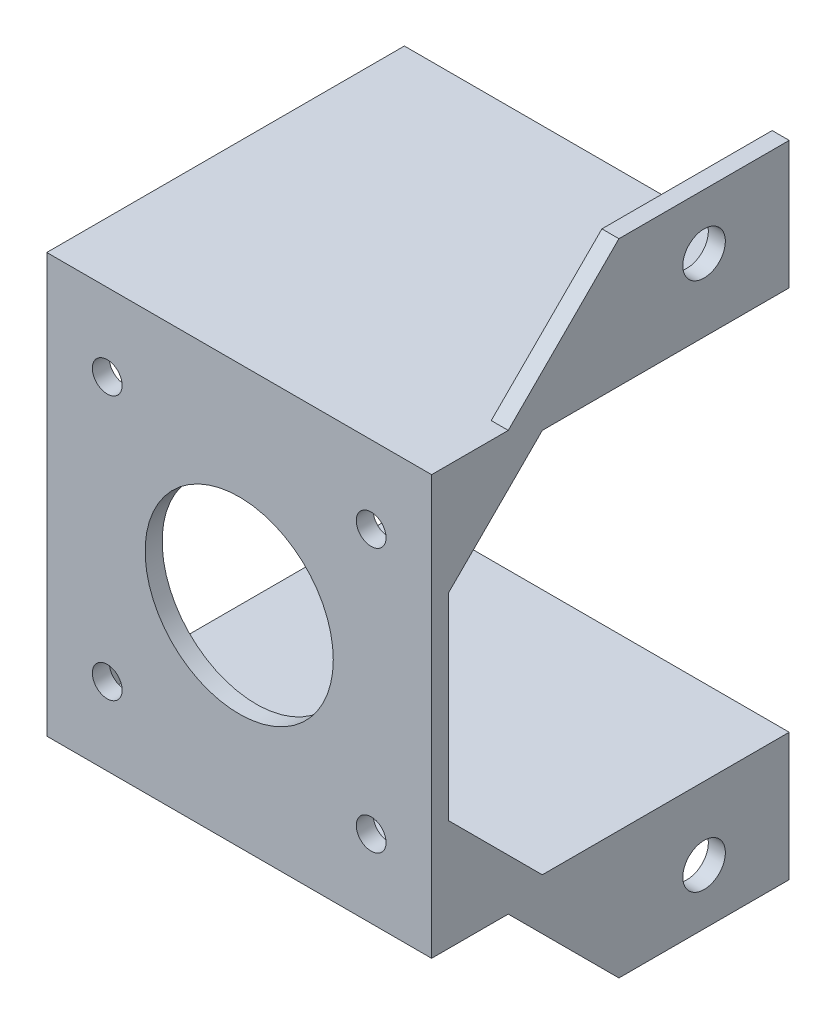
ISO-10303-21;
HEADER;
FILE_DESCRIPTION(('STEP AP214'),'2;1');
FILE_NAME('part.step','',(''),(''),'','','');
FILE_SCHEMA(('AUTOMOTIVE_DESIGN { 1 0 10303 214 1 1 1 1 }'));
ENDSEC;
DATA;
#1=APPLICATION_CONTEXT('core data for automotive mechanical design processes');
#2=APPLICATION_PROTOCOL_DEFINITION('international standard','automotive_design',2000,#1);
#3=PRODUCT_CONTEXT('',#1,'mechanical');
#4=PRODUCT('Part','Part','',(#3));
#5=PRODUCT_RELATED_PRODUCT_CATEGORY('part','',(#4));
#6=PRODUCT_DEFINITION_FORMATION('','',#4);
#7=PRODUCT_DEFINITION_CONTEXT('part definition',#1,'design');
#8=PRODUCT_DEFINITION('design','',#6,#7);
#9=PRODUCT_DEFINITION_SHAPE('','',#8);
#10=(LENGTH_UNIT() NAMED_UNIT(*) SI_UNIT(.MILLI.,.METRE.));
#11=(NAMED_UNIT(*) PLANE_ANGLE_UNIT() SI_UNIT($,.RADIAN.));
#12=(NAMED_UNIT(*) SI_UNIT($,.STERADIAN.) SOLID_ANGLE_UNIT());
#13=UNCERTAINTY_MEASURE_WITH_UNIT(LENGTH_MEASURE(1.E-05),#10,'distance_accuracy_value','');
#14=(GEOMETRIC_REPRESENTATION_CONTEXT(3) GLOBAL_UNCERTAINTY_ASSIGNED_CONTEXT((#13)) GLOBAL_UNIT_ASSIGNED_CONTEXT((#10,
#11,#12)) REPRESENTATION_CONTEXT('',''));
#15=CARTESIAN_POINT('',(0.,0.,0.));
#16=DIRECTION('',(0.,0.,1.));
#17=DIRECTION('',(1.,0.,0.));
#18=AXIS2_PLACEMENT_3D('',#15,#16,#17);
#19=CARTESIAN_POINT('',(0.,0.,2.));
#20=DIRECTION('',(0.,0.,-1.));
#21=DIRECTION('',(-1.,0.,0.));
#22=AXIS2_PLACEMENT_3D('',#19,#20,#21);
#23=PLANE('',#22);
#24=DIRECTION('',(0.,1.,0.));
#25=VECTOR('',#24,1.);
#26=CARTESIAN_POINT('',(22.6,-22.6,2.));
#27=LINE('',#26,#25);
#28=CARTESIAN_POINT('',(22.6,-24.6,2.));
#29=VERTEX_POINT('',#28);
#30=CARTESIAN_POINT('',(22.6,24.6,2.));
#31=VERTEX_POINT('',#30);
#32=EDGE_CURVE('E340',#29,#31,#27,.T.);
#33=ORIENTED_EDGE('',*,*,#32,.T.);
#34=DIRECTION('',(-1.,0.,0.));
#35=VECTOR('',#34,1.);
#36=CARTESIAN_POINT('',(22.6,24.6,2.));
#37=LINE('',#36,#35);
#38=CARTESIAN_POINT('',(-22.6,24.6,2.));
#39=VERTEX_POINT('',#38);
#40=EDGE_CURVE('E262',#31,#39,#37,.T.);
#41=ORIENTED_EDGE('',*,*,#40,.T.);
#42=DIRECTION('',(0.,-1.,0.));
#43=VECTOR('',#42,1.);
#44=CARTESIAN_POINT('',(-22.6,-22.6,2.));
#45=LINE('',#44,#43);
#46=CARTESIAN_POINT('',(-22.6,-24.6,2.));
#47=VERTEX_POINT('',#46);
#48=EDGE_CURVE('E343',#39,#47,#45,.T.);
#49=ORIENTED_EDGE('',*,*,#48,.T.);
#50=DIRECTION('',(-1.,0.,0.));
#51=VECTOR('',#50,1.);
#52=CARTESIAN_POINT('',(22.6,-24.6,2.));
#53=LINE('',#52,#51);
#54=EDGE_CURVE('E462',#29,#47,#53,.T.);
#55=ORIENTED_EDGE('',*,*,#54,.F.);
#56=EDGE_LOOP('',(#33,#41,#49,#55));
#57=FACE_BOUND('',#56,.T.);
#58=CARTESIAN_POINT('',(-15.5,15.5,2.));
#59=DIRECTION('',(0.,0.,1.));
#60=DIRECTION('',(1.,0.,0.));
#61=AXIS2_PLACEMENT_3D('',#58,#59,#60);
#62=CIRCLE('',#61,1.75);
#63=CARTESIAN_POINT('',(-13.75,15.5,2.));
#64=VERTEX_POINT('',#63);
#65=EDGE_CURVE('E333',#64,#64,#62,.T.);
#66=ORIENTED_EDGE('',*,*,#65,.F.);
#67=EDGE_LOOP('',(#66));
#68=FACE_BOUND('',#67,.T.);
#69=CARTESIAN_POINT('',(15.5,15.5,2.));
#70=DIRECTION('',(0.,0.,1.));
#71=DIRECTION('',(1.,0.,0.));
#72=AXIS2_PLACEMENT_3D('',#69,#70,#71);
#73=CIRCLE('',#72,1.75);
#74=CARTESIAN_POINT('',(17.25,15.5,2.));
#75=VERTEX_POINT('',#74);
#76=EDGE_CURVE('E325',#75,#75,#73,.T.);
#77=ORIENTED_EDGE('',*,*,#76,.F.);
#78=EDGE_LOOP('',(#77));
#79=FACE_BOUND('',#78,.T.);
#80=CARTESIAN_POINT('',(-15.5,-15.5,2.));
#81=DIRECTION('',(0.,0.,1.));
#82=DIRECTION('',(1.,0.,0.));
#83=AXIS2_PLACEMENT_3D('',#80,#81,#82);
#84=CIRCLE('',#83,1.75);
#85=CARTESIAN_POINT('',(-13.75,-15.5,2.));
#86=VERTEX_POINT('',#85);
#87=EDGE_CURVE('E317',#86,#86,#84,.T.);
#88=ORIENTED_EDGE('',*,*,#87,.F.);
#89=EDGE_LOOP('',(#88));
#90=FACE_BOUND('',#89,.T.);
#91=CARTESIAN_POINT('',(15.5,-15.5,2.));
#92=DIRECTION('',(0.,0.,1.));
#93=DIRECTION('',(1.,0.,0.));
#94=AXIS2_PLACEMENT_3D('',#91,#92,#93);
#95=CIRCLE('',#94,1.75);
#96=CARTESIAN_POINT('',(17.25,-15.5,2.));
#97=VERTEX_POINT('',#96);
#98=EDGE_CURVE('E309',#97,#97,#95,.T.);
#99=ORIENTED_EDGE('',*,*,#98,.F.);
#100=EDGE_LOOP('',(#99));
#101=FACE_BOUND('',#100,.T.);
#102=CARTESIAN_POINT('',(0.,0.,2.));
#103=DIRECTION('',(0.,0.,1.));
#104=DIRECTION('',(1.,0.,0.));
#105=AXIS2_PLACEMENT_3D('',#102,#103,#104);
#106=CIRCLE('',#105,11.05);
#107=CARTESIAN_POINT('',(11.05,0.,2.));
#108=VERTEX_POINT('',#107);
#109=EDGE_CURVE('E301',#108,#108,#106,.T.);
#110=ORIENTED_EDGE('',*,*,#109,.F.);
#111=EDGE_LOOP('',(#110));
#112=FACE_BOUND('',#111,.T.);
#113=ADVANCED_FACE('F39',(#57,#68,#79,#90,#101,#112),#23,.F.);
#114=CARTESIAN_POINT('',(0.,0.,0.));
#115=DIRECTION('',(0.,0.,-1.));
#116=DIRECTION('',(-1.,0.,0.));
#117=AXIS2_PLACEMENT_3D('',#114,#115,#116);
#118=PLANE('',#117);
#119=DIRECTION('',(1.,0.,0.));
#120=VECTOR('',#119,1.);
#121=CARTESIAN_POINT('',(0.,-11.6,0.));
#122=LINE('',#121,#120);
#123=CARTESIAN_POINT('',(21.6,-11.6,0.));
#124=VERTEX_POINT('',#123);
#125=CARTESIAN_POINT('',(22.6,-11.6,0.));
#126=VERTEX_POINT('',#125);
#127=EDGE_CURVE('E195',#124,#126,#122,.T.);
#128=ORIENTED_EDGE('',*,*,#127,.F.);
#129=DIRECTION('',(0.,1.,0.));
#130=VECTOR('',#129,1.);
#131=CARTESIAN_POINT('',(21.6,0.,0.));
#132=LINE('',#131,#130);
#133=CARTESIAN_POINT('',(21.6,-22.6,0.));
#134=VERTEX_POINT('',#133);
#135=EDGE_CURVE('E385',#134,#124,#132,.T.);
#136=ORIENTED_EDGE('',*,*,#135,.F.);
#137=DIRECTION('',(1.,0.,0.));
#138=VECTOR('',#137,1.);
#139=CARTESIAN_POINT('',(-22.6,-22.6,0.));
#140=LINE('',#139,#138);
#141=CARTESIAN_POINT('',(-21.6,-22.6,0.));
#142=VERTEX_POINT('',#141);
#143=EDGE_CURVE('E344',#142,#134,#140,.T.);
#144=ORIENTED_EDGE('',*,*,#143,.F.);
#145=DIRECTION('',(0.,1.,0.));
#146=VECTOR('',#145,1.);
#147=CARTESIAN_POINT('',(-21.6,0.,0.));
#148=LINE('',#147,#146);
#149=CARTESIAN_POINT('',(-21.6,-11.6,0.));
#150=VERTEX_POINT('',#149);
#151=EDGE_CURVE('E405',#142,#150,#148,.T.);
#152=ORIENTED_EDGE('',*,*,#151,.T.);
#153=DIRECTION('',(1.,0.,0.));
#154=VECTOR('',#153,1.);
#155=CARTESIAN_POINT('',(0.,-11.6,0.));
#156=LINE('',#155,#154);
#157=CARTESIAN_POINT('',(-22.6,-11.6,0.));
#158=VERTEX_POINT('',#157);
#159=EDGE_CURVE('E411',#158,#150,#156,.T.);
#160=ORIENTED_EDGE('',*,*,#159,.F.);
#161=DIRECTION('',(0.,-1.,0.));
#162=VECTOR('',#161,1.);
#163=CARTESIAN_POINT('',(-22.6,-22.6,0.));
#164=LINE('',#163,#162);
#165=CARTESIAN_POINT('',(-22.6,11.6,0.));
#166=VERTEX_POINT('',#165);
#167=EDGE_CURVE('E354',#166,#158,#164,.T.);
#168=ORIENTED_EDGE('',*,*,#167,.F.);
#169=DIRECTION('',(-1.,0.,0.));
#170=VECTOR('',#169,1.);
#171=CARTESIAN_POINT('',(0.,11.6,0.));
#172=LINE('',#171,#170);
#173=CARTESIAN_POINT('',(-21.6,11.6,0.));
#174=VERTEX_POINT('',#173);
#175=EDGE_CURVE('E426',#174,#166,#172,.T.);
#176=ORIENTED_EDGE('',*,*,#175,.F.);
#177=DIRECTION('',(0.,-1.,0.));
#178=VECTOR('',#177,1.);
#179=CARTESIAN_POINT('',(-21.6,0.,0.));
#180=LINE('',#179,#178);
#181=CARTESIAN_POINT('',(-21.6,22.6,0.));
#182=VERTEX_POINT('',#181);
#183=EDGE_CURVE('E420',#182,#174,#180,.T.);
#184=ORIENTED_EDGE('',*,*,#183,.F.);
#185=DIRECTION('',(-1.,0.,0.));
#186=VECTOR('',#185,1.);
#187=CARTESIAN_POINT('',(-22.6,22.6,0.));
#188=LINE('',#187,#186);
#189=CARTESIAN_POINT('',(21.6,22.6,0.));
#190=VERTEX_POINT('',#189);
#191=EDGE_CURVE('E351',#190,#182,#188,.T.);
#192=ORIENTED_EDGE('',*,*,#191,.F.);
#193=DIRECTION('',(0.,1.,0.));
#194=VECTOR('',#193,1.);
#195=CARTESIAN_POINT('',(21.6,0.,0.));
#196=LINE('',#195,#194);
#197=CARTESIAN_POINT('',(21.6,11.6,0.));
#198=VERTEX_POINT('',#197);
#199=EDGE_CURVE('E55',#198,#190,#196,.T.);
#200=ORIENTED_EDGE('',*,*,#199,.F.);
#201=DIRECTION('',(-1.,0.,0.));
#202=VECTOR('',#201,1.);
#203=CARTESIAN_POINT('',(0.,11.6,0.));
#204=LINE('',#203,#202);
#205=CARTESIAN_POINT('',(22.6,11.6,0.));
#206=VERTEX_POINT('',#205);
#207=EDGE_CURVE('E390',#206,#198,#204,.T.);
#208=ORIENTED_EDGE('',*,*,#207,.F.);
#209=DIRECTION('',(0.,1.,0.));
#210=VECTOR('',#209,1.);
#211=CARTESIAN_POINT('',(22.6,-22.6,0.));
#212=LINE('',#211,#210);
#213=EDGE_CURVE('E63',#126,#206,#212,.T.);
#214=ORIENTED_EDGE('',*,*,#213,.F.);
#215=EDGE_LOOP('',(#128,#136,#144,#152,#160,#168,#176,#184,#192,#200,#208,#214));
#216=FACE_BOUND('',#215,.T.);
#217=CARTESIAN_POINT('',(15.5,-15.5,0.));
#218=DIRECTION('',(0.,0.,1.));
#219=DIRECTION('',(1.,0.,0.));
#220=AXIS2_PLACEMENT_3D('',#217,#218,#219);
#221=CIRCLE('',#220,1.75);
#222=CARTESIAN_POINT('',(17.25,-15.5,0.));
#223=VERTEX_POINT('',#222);
#224=EDGE_CURVE('E305',#223,#223,#221,.T.);
#225=ORIENTED_EDGE('',*,*,#224,.T.);
#226=EDGE_LOOP('',(#225));
#227=FACE_BOUND('',#226,.T.);
#228=CARTESIAN_POINT('',(15.5,15.5,0.));
#229=DIRECTION('',(0.,0.,1.));
#230=DIRECTION('',(1.,0.,0.));
#231=AXIS2_PLACEMENT_3D('',#228,#229,#230);
#232=CIRCLE('',#231,1.75);
#233=CARTESIAN_POINT('',(17.25,15.5,0.));
#234=VERTEX_POINT('',#233);
#235=EDGE_CURVE('E321',#234,#234,#232,.T.);
#236=ORIENTED_EDGE('',*,*,#235,.T.);
#237=EDGE_LOOP('',(#236));
#238=FACE_BOUND('',#237,.T.);
#239=CARTESIAN_POINT('',(-15.5,15.5,0.));
#240=DIRECTION('',(0.,0.,1.));
#241=DIRECTION('',(1.,0.,0.));
#242=AXIS2_PLACEMENT_3D('',#239,#240,#241);
#243=CIRCLE('',#242,1.75);
#244=CARTESIAN_POINT('',(-13.75,15.5,0.));
#245=VERTEX_POINT('',#244);
#246=EDGE_CURVE('E329',#245,#245,#243,.T.);
#247=ORIENTED_EDGE('',*,*,#246,.T.);
#248=EDGE_LOOP('',(#247));
#249=FACE_BOUND('',#248,.T.);
#250=CARTESIAN_POINT('',(-15.5,-15.5,0.));
#251=DIRECTION('',(0.,0.,1.));
#252=DIRECTION('',(1.,0.,0.));
#253=AXIS2_PLACEMENT_3D('',#250,#251,#252);
#254=CIRCLE('',#253,1.75);
#255=CARTESIAN_POINT('',(-13.75,-15.5,0.));
#256=VERTEX_POINT('',#255);
#257=EDGE_CURVE('E313',#256,#256,#254,.T.);
#258=ORIENTED_EDGE('',*,*,#257,.T.);
#259=EDGE_LOOP('',(#258));
#260=FACE_BOUND('',#259,.T.);
#261=CARTESIAN_POINT('',(0.,0.,0.));
#262=DIRECTION('',(0.,0.,1.));
#263=DIRECTION('',(1.,0.,0.));
#264=AXIS2_PLACEMENT_3D('',#261,#262,#263);
#265=CIRCLE('',#264,11.05);
#266=CARTESIAN_POINT('',(11.05,0.,0.));
#267=VERTEX_POINT('',#266);
#268=EDGE_CURVE('E290',#267,#267,#265,.T.);
#269=ORIENTED_EDGE('',*,*,#268,.T.);
#270=EDGE_LOOP('',(#269));
#271=FACE_BOUND('',#270,.T.);
#272=ADVANCED_FACE('F527',(#216,#227,#238,#249,#260,#271),#118,.T.);
#273=CARTESIAN_POINT('',(22.6,-22.6,2.));
#274=DIRECTION('',(-1.,0.,0.));
#275=DIRECTION('',(0.,0.,1.));
#276=AXIS2_PLACEMENT_3D('',#273,#274,#275);
#277=PLANE('',#276);
#278=DIRECTION('',(0.,0.707106781186547,0.707106781186547));
#279=VECTOR('',#278,1.);
#280=CARTESIAN_POINT('',(22.6,-24.6,-13.));
#281=LINE('',#280,#279);
#282=CARTESIAN_POINT('',(22.6,-22.6,-11.));
#283=VERTEX_POINT('',#282);
#284=EDGE_CURVE('E190',#283,#126,#281,.T.);
#285=ORIENTED_EDGE('',*,*,#284,.T.);
#286=ORIENTED_EDGE('',*,*,#213,.T.);
#287=DIRECTION('',(0.,0.707106781186547,-0.707106781186548));
#288=VECTOR('',#287,1.);
#289=CARTESIAN_POINT('',(22.6,9.59999999999998,2.));
#290=LINE('',#289,#288);
#291=CARTESIAN_POINT('',(22.6,22.6,-11.));
#292=VERTEX_POINT('',#291);
#293=EDGE_CURVE('E375',#206,#292,#290,.T.);
#294=ORIENTED_EDGE('',*,*,#293,.T.);
#295=DIRECTION('',(0.,0.,1.));
#296=VECTOR('',#295,1.);
#297=CARTESIAN_POINT('',(22.6,22.6,-40.));
#298=LINE('',#297,#296);
#299=CARTESIAN_POINT('',(22.6,22.6,-40.));
#300=VERTEX_POINT('',#299);
#301=EDGE_CURVE('E295',#300,#292,#298,.T.);
#302=ORIENTED_EDGE('',*,*,#301,.F.);
#303=DIRECTION('',(0.,1.,0.));
#304=VECTOR('',#303,1.);
#305=CARTESIAN_POINT('',(22.6,22.6,-40.));
#306=LINE('',#305,#304);
#307=CARTESIAN_POINT('',(22.6,37.6,-40.));
#308=VERTEX_POINT('',#307);
#309=EDGE_CURVE('E277',#300,#308,#306,.T.);
#310=ORIENTED_EDGE('',*,*,#309,.T.);
#311=DIRECTION('',(0.,0.,1.));
#312=VECTOR('',#311,1.);
#313=CARTESIAN_POINT('',(22.6,37.6,0.));
#314=LINE('',#313,#312);
#315=CARTESIAN_POINT('',(22.6,37.6,-20.));
#316=VERTEX_POINT('',#315);
#317=EDGE_CURVE('E217',#308,#316,#314,.T.);
#318=ORIENTED_EDGE('',*,*,#317,.T.);
#319=DIRECTION('',(0.,-0.707106781186544,0.707106781186551));
#320=VECTOR('',#319,1.);
#321=CARTESIAN_POINT('',(22.6,8.80000000000019,8.8000000000001));
#322=LINE('',#321,#320);
#323=CARTESIAN_POINT('',(22.6,24.6,-6.99999999999987));
#324=VERTEX_POINT('',#323);
#325=EDGE_CURVE('E252',#316,#324,#322,.T.);
#326=ORIENTED_EDGE('',*,*,#325,.T.);
#327=DIRECTION('',(0.,0.,1.));
#328=VECTOR('',#327,1.);
#329=CARTESIAN_POINT('',(22.6,24.6,-40.));
#330=LINE('',#329,#328);
#331=EDGE_CURVE('E291',#324,#31,#330,.T.);
#332=ORIENTED_EDGE('',*,*,#331,.T.);
#333=ORIENTED_EDGE('',*,*,#32,.F.);
#334=DIRECTION('',(0.,0.,1.));
#335=VECTOR('',#334,1.);
#336=CARTESIAN_POINT('',(22.6,-24.6,-40.));
#337=LINE('',#336,#335);
#338=CARTESIAN_POINT('',(22.6,-24.6,-6.99999999999987));
#339=VERTEX_POINT('',#338);
#340=EDGE_CURVE('E213',#339,#29,#337,.T.);
#341=ORIENTED_EDGE('',*,*,#340,.F.);
#342=DIRECTION('',(0.,0.707106781186544,0.707106781186551));
#343=VECTOR('',#342,1.);
#344=CARTESIAN_POINT('',(22.6,-8.80000000000019,8.8000000000001));
#345=LINE('',#344,#343);
#346=CARTESIAN_POINT('',(22.6,-37.6,-20.));
#347=VERTEX_POINT('',#346);
#348=EDGE_CURVE('E429',#347,#339,#345,.T.);
#349=ORIENTED_EDGE('',*,*,#348,.F.);
#350=DIRECTION('',(0.,0.,1.));
#351=VECTOR('',#350,1.);
#352=CARTESIAN_POINT('',(22.6,-37.6,0.));
#353=LINE('',#352,#351);
#354=CARTESIAN_POINT('',(22.6,-37.6,-40.));
#355=VERTEX_POINT('',#354);
#356=EDGE_CURVE('E452',#355,#347,#353,.T.);
#357=ORIENTED_EDGE('',*,*,#356,.F.);
#358=DIRECTION('',(0.,-1.,0.));
#359=VECTOR('',#358,1.);
#360=CARTESIAN_POINT('',(22.6,-22.6,-40.));
#361=LINE('',#360,#359);
#362=CARTESIAN_POINT('',(22.6,-22.6,-40.));
#363=VERTEX_POINT('',#362);
#364=EDGE_CURVE('E210',#363,#355,#361,.T.);
#365=ORIENTED_EDGE('',*,*,#364,.F.);
#366=DIRECTION('',(0.,0.,1.));
#367=VECTOR('',#366,1.);
#368=CARTESIAN_POINT('',(22.6,-22.6,-40.));
#369=LINE('',#368,#367);
#370=EDGE_CURVE('E204',#363,#283,#369,.T.);
#371=ORIENTED_EDGE('',*,*,#370,.T.);
#372=EDGE_LOOP('',(#285,#286,#294,#302,#310,#318,#326,#332,#333,#341,#349,#357,#365,#371));
#373=FACE_BOUND('',#372,.T.);
#374=CARTESIAN_POINT('',(22.6,-31.1,-30.));
#375=DIRECTION('',(-1.,0.,0.));
#376=DIRECTION('',(0.,-1.,0.));
#377=AXIS2_PLACEMENT_3D('',#374,#375,#376);
#378=CIRCLE('',#377,2.5);
#379=CARTESIAN_POINT('',(22.6,-33.6,-30.));
#380=VERTEX_POINT('',#379);
#381=EDGE_CURVE('E435',#380,#380,#378,.T.);
#382=ORIENTED_EDGE('',*,*,#381,.T.);
#383=EDGE_LOOP('',(#382));
#384=FACE_BOUND('',#383,.T.);
#385=CARTESIAN_POINT('',(22.6,31.1,-30.));
#386=DIRECTION('',(1.,0.,0.));
#387=DIRECTION('',(0.,1.,0.));
#388=AXIS2_PLACEMENT_3D('',#385,#386,#387);
#389=CIRCLE('',#388,2.5);
#390=CARTESIAN_POINT('',(22.6,33.6,-30.));
#391=VERTEX_POINT('',#390);
#392=EDGE_CURVE('E232',#391,#391,#389,.T.);
#393=ORIENTED_EDGE('',*,*,#392,.F.);
#394=EDGE_LOOP('',(#393));
#395=FACE_BOUND('',#394,.T.);
#396=ADVANCED_FACE('F41',(#373,#384,#395),#277,.F.);
#397=CARTESIAN_POINT('',(-22.6,-22.6,2.));
#398=DIRECTION('',(1.,0.,0.));
#399=DIRECTION('',(0.,1.,0.));
#400=AXIS2_PLACEMENT_3D('',#397,#398,#399);
#401=PLANE('',#400);
#402=ORIENTED_EDGE('',*,*,#167,.T.);
#403=DIRECTION('',(0.,-0.707106781186548,-0.707106781186547));
#404=VECTOR('',#403,1.);
#405=CARTESIAN_POINT('',(-22.6,-24.6,-13.));
#406=LINE('',#405,#404);
#407=CARTESIAN_POINT('',(-22.6,-22.6,-11.));
#408=VERTEX_POINT('',#407);
#409=EDGE_CURVE('E393',#158,#408,#406,.T.);
#410=ORIENTED_EDGE('',*,*,#409,.T.);
#411=DIRECTION('',(0.,0.,1.));
#412=VECTOR('',#411,1.);
#413=CARTESIAN_POINT('',(-22.6,-22.6,-40.));
#414=LINE('',#413,#412);
#415=CARTESIAN_POINT('',(-22.6,-22.6,-40.));
#416=VERTEX_POINT('',#415);
#417=EDGE_CURVE('E212',#416,#408,#414,.T.);
#418=ORIENTED_EDGE('',*,*,#417,.F.);
#419=DIRECTION('',(0.,1.,0.));
#420=VECTOR('',#419,1.);
#421=CARTESIAN_POINT('',(-22.6,-24.6,-40.));
#422=LINE('',#421,#420);
#423=CARTESIAN_POINT('',(-22.6,-24.6,-40.));
#424=VERTEX_POINT('',#423);
#425=EDGE_CURVE('E469',#424,#416,#422,.T.);
#426=ORIENTED_EDGE('',*,*,#425,.F.);
#427=DIRECTION('',(0.,0.,1.));
#428=VECTOR('',#427,1.);
#429=CARTESIAN_POINT('',(-22.6,-24.6,-40.));
#430=LINE('',#429,#428);
#431=EDGE_CURVE('E219',#424,#47,#430,.T.);
#432=ORIENTED_EDGE('',*,*,#431,.T.);
#433=ORIENTED_EDGE('',*,*,#48,.F.);
#434=DIRECTION('',(0.,0.,1.));
#435=VECTOR('',#434,1.);
#436=CARTESIAN_POINT('',(-22.6,24.6,-40.));
#437=LINE('',#436,#435);
#438=CARTESIAN_POINT('',(-22.6,24.6,-40.));
#439=VERTEX_POINT('',#438);
#440=EDGE_CURVE('E286',#439,#39,#437,.T.);
#441=ORIENTED_EDGE('',*,*,#440,.F.);
#442=DIRECTION('',(0.,-1.,0.));
#443=VECTOR('',#442,1.);
#444=CARTESIAN_POINT('',(-22.6,24.6,-40.));
#445=LINE('',#444,#443);
#446=CARTESIAN_POINT('',(-22.6,22.6,-40.));
#447=VERTEX_POINT('',#446);
#448=EDGE_CURVE('E269',#439,#447,#445,.T.);
#449=ORIENTED_EDGE('',*,*,#448,.T.);
#450=DIRECTION('',(0.,0.,1.));
#451=VECTOR('',#450,1.);
#452=CARTESIAN_POINT('',(-22.6,22.6,-40.));
#453=LINE('',#452,#451);
#454=CARTESIAN_POINT('',(-22.6,22.6,-11.));
#455=VERTEX_POINT('',#454);
#456=EDGE_CURVE('E283',#447,#455,#453,.T.);
#457=ORIENTED_EDGE('',*,*,#456,.T.);
#458=DIRECTION('',(0.,-0.707106781186547,0.707106781186548));
#459=VECTOR('',#458,1.);
#460=CARTESIAN_POINT('',(-22.6,24.6,-13.));
#461=LINE('',#460,#459);
#462=EDGE_CURVE('E415',#455,#166,#461,.T.);
#463=ORIENTED_EDGE('',*,*,#462,.T.);
#464=EDGE_LOOP('',(#402,#410,#418,#426,#432,#433,#441,#449,#457,#463));
#465=FACE_BOUND('',#464,.T.);
#466=ADVANCED_FACE('F494',(#465),#401,.F.);
#467=CARTESIAN_POINT('',(-15.5,15.5,2.));
#468=DIRECTION('',(0.,0.,-1.));
#469=DIRECTION('',(-1.,0.,0.));
#470=AXIS2_PLACEMENT_3D('',#467,#468,#469);
#471=CYLINDRICAL_SURFACE('',#470,1.75);
#472=ORIENTED_EDGE('',*,*,#65,.T.);
#473=EDGE_LOOP('',(#472));
#474=FACE_BOUND('',#473,.T.);
#475=ORIENTED_EDGE('',*,*,#246,.F.);
#476=EDGE_LOOP('',(#475));
#477=FACE_BOUND('',#476,.T.);
#478=ADVANCED_FACE('F561',(#474,#477),#471,.F.);
#479=CARTESIAN_POINT('',(15.5,15.5,2.));
#480=DIRECTION('',(0.,0.,-1.));
#481=DIRECTION('',(-1.,0.,0.));
#482=AXIS2_PLACEMENT_3D('',#479,#480,#481);
#483=CYLINDRICAL_SURFACE('',#482,1.75);
#484=ORIENTED_EDGE('',*,*,#76,.T.);
#485=EDGE_LOOP('',(#484));
#486=FACE_BOUND('',#485,.T.);
#487=ORIENTED_EDGE('',*,*,#235,.F.);
#488=EDGE_LOOP('',(#487));
#489=FACE_BOUND('',#488,.T.);
#490=ADVANCED_FACE('F568',(#486,#489),#483,.F.);
#491=CARTESIAN_POINT('',(-15.5,-15.5,2.));
#492=DIRECTION('',(0.,0.,-1.));
#493=DIRECTION('',(-1.,0.,0.));
#494=AXIS2_PLACEMENT_3D('',#491,#492,#493);
#495=CYLINDRICAL_SURFACE('',#494,1.75);
#496=ORIENTED_EDGE('',*,*,#87,.T.);
#497=EDGE_LOOP('',(#496));
#498=FACE_BOUND('',#497,.T.);
#499=ORIENTED_EDGE('',*,*,#257,.F.);
#500=EDGE_LOOP('',(#499));
#501=FACE_BOUND('',#500,.T.);
#502=ADVANCED_FACE('F736',(#498,#501),#495,.F.);
#503=CARTESIAN_POINT('',(15.5,-15.5,2.));
#504=DIRECTION('',(0.,0.,-1.));
#505=DIRECTION('',(-1.,0.,0.));
#506=AXIS2_PLACEMENT_3D('',#503,#504,#505);
#507=CYLINDRICAL_SURFACE('',#506,1.75);
#508=ORIENTED_EDGE('',*,*,#98,.T.);
#509=EDGE_LOOP('',(#508));
#510=FACE_BOUND('',#509,.T.);
#511=ORIENTED_EDGE('',*,*,#224,.F.);
#512=EDGE_LOOP('',(#511));
#513=FACE_BOUND('',#512,.T.);
#514=ADVANCED_FACE('F725',(#510,#513),#507,.F.);
#515=CARTESIAN_POINT('',(0.,0.,2.));
#516=DIRECTION('',(0.,0.,-1.));
#517=DIRECTION('',(-1.,0.,0.));
#518=AXIS2_PLACEMENT_3D('',#515,#516,#517);
#519=CYLINDRICAL_SURFACE('',#518,11.05);
#520=ORIENTED_EDGE('',*,*,#109,.T.);
#521=EDGE_LOOP('',(#520));
#522=FACE_BOUND('',#521,.T.);
#523=ORIENTED_EDGE('',*,*,#268,.F.);
#524=EDGE_LOOP('',(#523));
#525=FACE_BOUND('',#524,.T.);
#526=ADVANCED_FACE('F720',(#522,#525),#519,.F.);
#527=CARTESIAN_POINT('',(22.6,24.6,-40.));
#528=DIRECTION('',(0.,1.,0.));
#529=DIRECTION('',(-1.,0.,0.));
#530=AXIS2_PLACEMENT_3D('',#527,#528,#529);
#531=PLANE('',#530);
#532=ORIENTED_EDGE('',*,*,#440,.T.);
#533=ORIENTED_EDGE('',*,*,#40,.F.);
#534=ORIENTED_EDGE('',*,*,#331,.F.);
#535=DIRECTION('',(1.,0.,0.));
#536=VECTOR('',#535,1.);
#537=CARTESIAN_POINT('',(20.6,24.6,-6.99999999999986));
#538=LINE('',#537,#536);
#539=CARTESIAN_POINT('',(20.6,24.6,-6.99999999999986));
#540=VERTEX_POINT('',#539);
#541=EDGE_CURVE('E259',#540,#324,#538,.T.);
#542=ORIENTED_EDGE('',*,*,#541,.F.);
#543=DIRECTION('',(0.,0.,1.));
#544=VECTOR('',#543,1.);
#545=CARTESIAN_POINT('',(20.6,24.6,0.));
#546=LINE('',#545,#544);
#547=CARTESIAN_POINT('',(20.6,24.6,-40.));
#548=VERTEX_POINT('',#547);
#549=EDGE_CURVE('E227',#548,#540,#546,.T.);
#550=ORIENTED_EDGE('',*,*,#549,.F.);
#551=DIRECTION('',(-1.,0.,0.));
#552=VECTOR('',#551,1.);
#553=CARTESIAN_POINT('',(22.6,24.6,-40.));
#554=LINE('',#553,#552);
#555=EDGE_CURVE('E280',#548,#439,#554,.T.);
#556=ORIENTED_EDGE('',*,*,#555,.T.);
#557=EDGE_LOOP('',(#532,#533,#534,#542,#550,#556));
#558=FACE_BOUND('',#557,.T.);
#559=ADVANCED_FACE('F513',(#558),#531,.T.);
#560=CARTESIAN_POINT('',(-22.6,22.6,-40.));
#561=DIRECTION('',(0.,-1.,0.));
#562=DIRECTION('',(1.,0.,0.));
#563=AXIS2_PLACEMENT_3D('',#560,#561,#562);
#564=PLANE('',#563);
#565=DIRECTION('',(1.,0.,0.));
#566=VECTOR('',#565,1.);
#567=CARTESIAN_POINT('',(-22.6,22.6,-11.));
#568=LINE('',#567,#566);
#569=CARTESIAN_POINT('',(21.6,22.6,-11.));
#570=VERTEX_POINT('',#569);
#571=EDGE_CURVE('E48',#570,#292,#568,.T.);
#572=ORIENTED_EDGE('',*,*,#571,.F.);
#573=DIRECTION('',(0.,0.,-1.));
#574=VECTOR('',#573,1.);
#575=CARTESIAN_POINT('',(21.6,22.6,-40.));
#576=LINE('',#575,#574);
#577=EDGE_CURVE('E366',#190,#570,#576,.T.);
#578=ORIENTED_EDGE('',*,*,#577,.F.);
#579=ORIENTED_EDGE('',*,*,#191,.T.);
#580=DIRECTION('',(0.,0.,1.));
#581=VECTOR('',#580,1.);
#582=CARTESIAN_POINT('',(-21.6,22.6,-40.));
#583=LINE('',#582,#581);
#584=CARTESIAN_POINT('',(-21.6,22.6,-11.));
#585=VERTEX_POINT('',#584);
#586=EDGE_CURVE('E348',#585,#182,#583,.T.);
#587=ORIENTED_EDGE('',*,*,#586,.F.);
#588=DIRECTION('',(1.,0.,0.));
#589=VECTOR('',#588,1.);
#590=CARTESIAN_POINT('',(-22.6,22.6,-11.));
#591=LINE('',#590,#589);
#592=EDGE_CURVE('E363',#455,#585,#591,.T.);
#593=ORIENTED_EDGE('',*,*,#592,.F.);
#594=ORIENTED_EDGE('',*,*,#456,.F.);
#595=DIRECTION('',(1.,0.,0.));
#596=VECTOR('',#595,1.);
#597=CARTESIAN_POINT('',(-22.6,22.6,-40.));
#598=LINE('',#597,#596);
#599=EDGE_CURVE('E273',#447,#300,#598,.T.);
#600=ORIENTED_EDGE('',*,*,#599,.T.);
#601=ORIENTED_EDGE('',*,*,#301,.T.);
#602=EDGE_LOOP('',(#572,#578,#579,#587,#593,#594,#600,#601));
#603=FACE_BOUND('',#602,.T.);
#604=ADVANCED_FACE('F520',(#603),#564,.T.);
#605=CARTESIAN_POINT('',(0.,0.,-40.));
#606=DIRECTION('',(0.,0.,1.));
#607=DIRECTION('',(1.,0.,0.));
#608=AXIS2_PLACEMENT_3D('',#605,#606,#607);
#609=PLANE('',#608);
#610=ORIENTED_EDGE('',*,*,#448,.F.);
#611=ORIENTED_EDGE('',*,*,#555,.F.);
#612=DIRECTION('',(0.,1.,0.));
#613=VECTOR('',#612,1.);
#614=CARTESIAN_POINT('',(20.6,0.,-40.));
#615=LINE('',#614,#613);
#616=CARTESIAN_POINT('',(20.6,37.6,-40.));
#617=VERTEX_POINT('',#616);
#618=EDGE_CURVE('E231',#548,#617,#615,.T.);
#619=ORIENTED_EDGE('',*,*,#618,.T.);
#620=DIRECTION('',(1.,0.,0.));
#621=VECTOR('',#620,1.);
#622=CARTESIAN_POINT('',(20.6,37.6,-40.));
#623=LINE('',#622,#621);
#624=EDGE_CURVE('E248',#617,#308,#623,.T.);
#625=ORIENTED_EDGE('',*,*,#624,.T.);
#626=ORIENTED_EDGE('',*,*,#309,.F.);
#627=ORIENTED_EDGE('',*,*,#599,.F.);
#628=EDGE_LOOP('',(#610,#611,#619,#625,#626,#627));
#629=FACE_BOUND('',#628,.T.);
#630=ADVANCED_FACE('F518',(#629),#609,.F.);
#631=CARTESIAN_POINT('',(20.6,8.80000000000019,8.8000000000001));
#632=DIRECTION('',(0.,0.707106781186551,0.707106781186544));
#633=DIRECTION('',(0.,-0.707106781186544,0.707106781186551));
#634=AXIS2_PLACEMENT_3D('',#631,#632,#633);
#635=PLANE('',#634);
#636=ORIENTED_EDGE('',*,*,#325,.F.);
#637=DIRECTION('',(1.,0.,0.));
#638=VECTOR('',#637,1.);
#639=CARTESIAN_POINT('',(20.6,37.6,-20.));
#640=LINE('',#639,#638);
#641=CARTESIAN_POINT('',(20.6,37.6,-20.));
#642=VERTEX_POINT('',#641);
#643=EDGE_CURVE('E263',#642,#316,#640,.T.);
#644=ORIENTED_EDGE('',*,*,#643,.F.);
#645=DIRECTION('',(0.,-0.707106781186544,0.707106781186551));
#646=VECTOR('',#645,1.);
#647=CARTESIAN_POINT('',(20.6,8.80000000000019,8.8000000000001));
#648=LINE('',#647,#646);
#649=EDGE_CURVE('E240',#642,#540,#648,.T.);
#650=ORIENTED_EDGE('',*,*,#649,.T.);
#651=ORIENTED_EDGE('',*,*,#541,.T.);
#652=EDGE_LOOP('',(#636,#644,#650,#651));
#653=FACE_BOUND('',#652,.T.);
#654=ADVANCED_FACE('F701',(#653),#635,.T.);
#655=CARTESIAN_POINT('',(20.6,37.6,0.));
#656=DIRECTION('',(0.,1.,0.));
#657=DIRECTION('',(-1.,0.,0.));
#658=AXIS2_PLACEMENT_3D('',#655,#656,#657);
#659=PLANE('',#658);
#660=ORIENTED_EDGE('',*,*,#317,.F.);
#661=ORIENTED_EDGE('',*,*,#624,.F.);
#662=DIRECTION('',(0.,0.,1.));
#663=VECTOR('',#662,1.);
#664=CARTESIAN_POINT('',(20.6,37.6,0.));
#665=LINE('',#664,#663);
#666=EDGE_CURVE('E236',#617,#642,#665,.T.);
#667=ORIENTED_EDGE('',*,*,#666,.T.);
#668=ORIENTED_EDGE('',*,*,#643,.T.);
#669=EDGE_LOOP('',(#660,#661,#667,#668));
#670=FACE_BOUND('',#669,.T.);
#671=ADVANCED_FACE('F691',(#670),#659,.T.);
#672=CARTESIAN_POINT('',(20.6,31.1,-30.));
#673=DIRECTION('',(1.,0.,0.));
#674=DIRECTION('',(0.,1.,0.));
#675=AXIS2_PLACEMENT_3D('',#672,#673,#674);
#676=CYLINDRICAL_SURFACE('',#675,2.5);
#677=CARTESIAN_POINT('',(20.6,31.1,-30.));
#678=DIRECTION('',(1.,0.,0.));
#679=DIRECTION('',(0.,1.,0.));
#680=AXIS2_PLACEMENT_3D('',#677,#678,#679);
#681=CIRCLE('',#680,2.5);
#682=CARTESIAN_POINT('',(20.6,33.6,-30.));
#683=VERTEX_POINT('',#682);
#684=EDGE_CURVE('E244',#683,#683,#681,.T.);
#685=ORIENTED_EDGE('',*,*,#684,.F.);
#686=EDGE_LOOP('',(#685));
#687=FACE_BOUND('',#686,.T.);
#688=ORIENTED_EDGE('',*,*,#392,.T.);
#689=EDGE_LOOP('',(#688));
#690=FACE_BOUND('',#689,.T.);
#691=ADVANCED_FACE('F679',(#687,#690),#676,.F.);
#692=CARTESIAN_POINT('',(20.6,0.,0.));
#693=DIRECTION('',(1.,0.,0.));
#694=DIRECTION('',(0.,1.,0.));
#695=AXIS2_PLACEMENT_3D('',#692,#693,#694);
#696=PLANE('',#695);
#697=ORIENTED_EDGE('',*,*,#549,.T.);
#698=ORIENTED_EDGE('',*,*,#649,.F.);
#699=ORIENTED_EDGE('',*,*,#666,.F.);
#700=ORIENTED_EDGE('',*,*,#618,.F.);
#701=EDGE_LOOP('',(#697,#698,#699,#700));
#702=FACE_BOUND('',#701,.T.);
#703=ORIENTED_EDGE('',*,*,#684,.T.);
#704=EDGE_LOOP('',(#703));
#705=FACE_BOUND('',#704,.T.);
#706=ADVANCED_FACE('F675',(#702,#705),#696,.F.);
#707=CARTESIAN_POINT('',(-22.6,-22.6,-40.));
#708=DIRECTION('',(0.,-1.,0.));
#709=DIRECTION('',(1.,0.,0.));
#710=AXIS2_PLACEMENT_3D('',#707,#708,#709);
#711=PLANE('',#710);
#712=DIRECTION('',(0.,0.,-1.));
#713=VECTOR('',#712,1.);
#714=CARTESIAN_POINT('',(21.6,-22.6,-40.));
#715=LINE('',#714,#713);
#716=CARTESIAN_POINT('',(21.6,-22.6,-11.));
#717=VERTEX_POINT('',#716);
#718=EDGE_CURVE('E207',#134,#717,#715,.T.);
#719=ORIENTED_EDGE('',*,*,#718,.T.);
#720=DIRECTION('',(1.,0.,0.));
#721=VECTOR('',#720,1.);
#722=CARTESIAN_POINT('',(-22.6,-22.6,-11.));
#723=LINE('',#722,#721);
#724=EDGE_CURVE('E11',#717,#283,#723,.T.);
#725=ORIENTED_EDGE('',*,*,#724,.T.);
#726=ORIENTED_EDGE('',*,*,#370,.F.);
#727=DIRECTION('',(1.,0.,0.));
#728=VECTOR('',#727,1.);
#729=CARTESIAN_POINT('',(-22.6,-22.6,-40.));
#730=LINE('',#729,#728);
#731=EDGE_CURVE('E226',#416,#363,#730,.T.);
#732=ORIENTED_EDGE('',*,*,#731,.F.);
#733=ORIENTED_EDGE('',*,*,#417,.T.);
#734=DIRECTION('',(1.,0.,0.));
#735=VECTOR('',#734,1.);
#736=CARTESIAN_POINT('',(-22.6,-22.6,-11.));
#737=LINE('',#736,#735);
#738=CARTESIAN_POINT('',(-21.6,-22.6,-11.));
#739=VERTEX_POINT('',#738);
#740=EDGE_CURVE('E408',#408,#739,#737,.T.);
#741=ORIENTED_EDGE('',*,*,#740,.T.);
#742=DIRECTION('',(0.,0.,-1.));
#743=VECTOR('',#742,1.);
#744=CARTESIAN_POINT('',(-21.6,-22.6,-40.));
#745=LINE('',#744,#743);
#746=EDGE_CURVE('E398',#142,#739,#745,.T.);
#747=ORIENTED_EDGE('',*,*,#746,.F.);
#748=ORIENTED_EDGE('',*,*,#143,.T.);
#749=EDGE_LOOP('',(#719,#725,#726,#732,#733,#741,#747,#748));
#750=FACE_BOUND('',#749,.T.);
#751=ADVANCED_FACE('F203',(#750),#711,.F.);
#752=CARTESIAN_POINT('',(22.6,-24.6,-40.));
#753=DIRECTION('',(0.,1.,0.));
#754=DIRECTION('',(-1.,0.,0.));
#755=AXIS2_PLACEMENT_3D('',#752,#753,#754);
#756=PLANE('',#755);
#757=DIRECTION('',(1.,0.,0.));
#758=VECTOR('',#757,1.);
#759=CARTESIAN_POINT('',(20.6,-24.6,-6.99999999999986));
#760=LINE('',#759,#758);
#761=CARTESIAN_POINT('',(20.6,-24.6,-6.99999999999986));
#762=VERTEX_POINT('',#761);
#763=EDGE_CURVE('E448',#762,#339,#760,.T.);
#764=ORIENTED_EDGE('',*,*,#763,.T.);
#765=ORIENTED_EDGE('',*,*,#340,.T.);
#766=ORIENTED_EDGE('',*,*,#54,.T.);
#767=ORIENTED_EDGE('',*,*,#431,.F.);
#768=DIRECTION('',(-1.,0.,0.));
#769=VECTOR('',#768,1.);
#770=CARTESIAN_POINT('',(22.6,-24.6,-40.));
#771=LINE('',#770,#769);
#772=CARTESIAN_POINT('',(20.6,-24.6,-40.));
#773=VERTEX_POINT('',#772);
#774=EDGE_CURVE('E473',#773,#424,#771,.T.);
#775=ORIENTED_EDGE('',*,*,#774,.F.);
#776=DIRECTION('',(0.,0.,1.));
#777=VECTOR('',#776,1.);
#778=CARTESIAN_POINT('',(20.6,-24.6,0.));
#779=LINE('',#778,#777);
#780=EDGE_CURVE('E430',#773,#762,#779,.T.);
#781=ORIENTED_EDGE('',*,*,#780,.T.);
#782=EDGE_LOOP('',(#764,#765,#766,#767,#775,#781));
#783=FACE_BOUND('',#782,.T.);
#784=ADVANCED_FACE('F483',(#783),#756,.F.);
#785=CARTESIAN_POINT('',(0.,0.,-40.));
#786=DIRECTION('',(0.,0.,1.));
#787=DIRECTION('',(1.,0.,0.));
#788=AXIS2_PLACEMENT_3D('',#785,#786,#787);
#789=PLANE('',#788);
#790=ORIENTED_EDGE('',*,*,#425,.T.);
#791=ORIENTED_EDGE('',*,*,#731,.T.);
#792=ORIENTED_EDGE('',*,*,#364,.T.);
#793=DIRECTION('',(1.,0.,0.));
#794=VECTOR('',#793,1.);
#795=CARTESIAN_POINT('',(20.6,-37.6,-40.));
#796=LINE('',#795,#794);
#797=CARTESIAN_POINT('',(20.6,-37.6,-40.));
#798=VERTEX_POINT('',#797);
#799=EDGE_CURVE('E458',#798,#355,#796,.T.);
#800=ORIENTED_EDGE('',*,*,#799,.F.);
#801=DIRECTION('',(0.,-1.,0.));
#802=VECTOR('',#801,1.);
#803=CARTESIAN_POINT('',(20.6,0.,-40.));
#804=LINE('',#803,#802);
#805=EDGE_CURVE('E441',#773,#798,#804,.T.);
#806=ORIENTED_EDGE('',*,*,#805,.F.);
#807=ORIENTED_EDGE('',*,*,#774,.T.);
#808=EDGE_LOOP('',(#790,#791,#792,#800,#806,#807));
#809=FACE_BOUND('',#808,.T.);
#810=ADVANCED_FACE('F497',(#809),#789,.F.);
#811=CARTESIAN_POINT('',(20.6,-37.6,0.));
#812=DIRECTION('',(0.,1.,0.));
#813=DIRECTION('',(-1.,0.,0.));
#814=AXIS2_PLACEMENT_3D('',#811,#812,#813);
#815=PLANE('',#814);
#816=ORIENTED_EDGE('',*,*,#356,.T.);
#817=DIRECTION('',(1.,0.,0.));
#818=VECTOR('',#817,1.);
#819=CARTESIAN_POINT('',(20.6,-37.6,-20.));
#820=LINE('',#819,#818);
#821=CARTESIAN_POINT('',(20.6,-37.6,-20.));
#822=VERTEX_POINT('',#821);
#823=EDGE_CURVE('E463',#822,#347,#820,.T.);
#824=ORIENTED_EDGE('',*,*,#823,.F.);
#825=DIRECTION('',(0.,0.,1.));
#826=VECTOR('',#825,1.);
#827=CARTESIAN_POINT('',(20.6,-37.6,0.));
#828=LINE('',#827,#826);
#829=EDGE_CURVE('E438',#798,#822,#828,.T.);
#830=ORIENTED_EDGE('',*,*,#829,.F.);
#831=ORIENTED_EDGE('',*,*,#799,.T.);
#832=EDGE_LOOP('',(#816,#824,#830,#831));
#833=FACE_BOUND('',#832,.T.);
#834=ADVANCED_FACE('F654',(#833),#815,.F.);
#835=CARTESIAN_POINT('',(20.6,-8.80000000000019,8.8000000000001));
#836=DIRECTION('',(0.,0.707106781186551,-0.707106781186544));
#837=DIRECTION('',(0.,0.707106781186544,0.707106781186551));
#838=AXIS2_PLACEMENT_3D('',#835,#836,#837);
#839=PLANE('',#838);
#840=ORIENTED_EDGE('',*,*,#348,.T.);
#841=ORIENTED_EDGE('',*,*,#763,.F.);
#842=DIRECTION('',(0.,0.707106781186544,0.707106781186551));
#843=VECTOR('',#842,1.);
#844=CARTESIAN_POINT('',(20.6,-8.80000000000019,8.8000000000001));
#845=LINE('',#844,#843);
#846=EDGE_CURVE('E434',#822,#762,#845,.T.);
#847=ORIENTED_EDGE('',*,*,#846,.F.);
#848=ORIENTED_EDGE('',*,*,#823,.T.);
#849=EDGE_LOOP('',(#840,#841,#847,#848));
#850=FACE_BOUND('',#849,.T.);
#851=ADVANCED_FACE('F508',(#850),#839,.F.);
#852=CARTESIAN_POINT('',(20.6,-31.1,-30.));
#853=DIRECTION('',(1.,0.,0.));
#854=DIRECTION('',(0.,1.,0.));
#855=AXIS2_PLACEMENT_3D('',#852,#853,#854);
#856=CYLINDRICAL_SURFACE('',#855,2.5);
#857=CARTESIAN_POINT('',(20.6,-31.1,-30.));
#858=DIRECTION('',(-1.,0.,0.));
#859=DIRECTION('',(0.,-1.,0.));
#860=AXIS2_PLACEMENT_3D('',#857,#858,#859);
#861=CIRCLE('',#860,2.5);
#862=CARTESIAN_POINT('',(20.6,-33.6,-30.));
#863=VERTEX_POINT('',#862);
#864=EDGE_CURVE('E444',#863,#863,#861,.T.);
#865=ORIENTED_EDGE('',*,*,#864,.T.);
#866=EDGE_LOOP('',(#865));
#867=FACE_BOUND('',#866,.T.);
#868=ORIENTED_EDGE('',*,*,#381,.F.);
#869=EDGE_LOOP('',(#868));
#870=FACE_BOUND('',#869,.T.);
#871=ADVANCED_FACE('F637',(#867,#870),#856,.F.);
#872=CARTESIAN_POINT('',(20.6,0.,0.));
#873=DIRECTION('',(1.,0.,0.));
#874=DIRECTION('',(0.,-1.,0.));
#875=AXIS2_PLACEMENT_3D('',#872,#873,#874);
#876=PLANE('',#875);
#877=ORIENTED_EDGE('',*,*,#780,.F.);
#878=ORIENTED_EDGE('',*,*,#805,.T.);
#879=ORIENTED_EDGE('',*,*,#829,.T.);
#880=ORIENTED_EDGE('',*,*,#846,.T.);
#881=EDGE_LOOP('',(#877,#878,#879,#880));
#882=FACE_BOUND('',#881,.T.);
#883=ORIENTED_EDGE('',*,*,#864,.F.);
#884=EDGE_LOOP('',(#883));
#885=FACE_BOUND('',#884,.T.);
#886=ADVANCED_FACE('F502',(#882,#885),#876,.F.);
#887=CARTESIAN_POINT('',(-21.6,24.6,-13.));
#888=DIRECTION('',(0.,-0.707106781186548,-0.707106781186547));
#889=DIRECTION('',(0.,0.707106781186547,-0.707106781186548));
#890=AXIS2_PLACEMENT_3D('',#887,#888,#889);
#891=PLANE('',#890);
#892=DIRECTION('',(0.,-0.707106781186547,0.707106781186548));
#893=VECTOR('',#892,1.);
#894=CARTESIAN_POINT('',(-21.6,24.6,-13.));
#895=LINE('',#894,#893);
#896=EDGE_CURVE('E416',#585,#174,#895,.T.);
#897=ORIENTED_EDGE('',*,*,#896,.T.);
#898=ORIENTED_EDGE('',*,*,#175,.T.);
#899=ORIENTED_EDGE('',*,*,#462,.F.);
#900=ORIENTED_EDGE('',*,*,#592,.T.);
#901=EDGE_LOOP('',(#897,#898,#899,#900));
#902=FACE_BOUND('',#901,.T.);
#903=ADVANCED_FACE('F614',(#902),#891,.T.);
#904=CARTESIAN_POINT('',(-21.6,0.,0.));
#905=DIRECTION('',(1.,0.,0.));
#906=DIRECTION('',(0.,0.,-1.));
#907=AXIS2_PLACEMENT_3D('',#904,#905,#906);
#908=PLANE('',#907);
#909=ORIENTED_EDGE('',*,*,#586,.T.);
#910=ORIENTED_EDGE('',*,*,#183,.T.);
#911=ORIENTED_EDGE('',*,*,#896,.F.);
#912=EDGE_LOOP('',(#909,#910,#911));
#913=FACE_BOUND('',#912,.T.);
#914=ADVANCED_FACE('F605',(#913),#908,.T.);
#915=CARTESIAN_POINT('',(-21.6,-24.6,-13.));
#916=DIRECTION('',(0.,0.707106781186547,-0.707106781186548));
#917=DIRECTION('',(0.,0.707106781186548,0.707106781186547));
#918=AXIS2_PLACEMENT_3D('',#915,#916,#917);
#919=PLANE('',#918);
#920=ORIENTED_EDGE('',*,*,#409,.F.);
#921=ORIENTED_EDGE('',*,*,#159,.T.);
#922=DIRECTION('',(0.,-0.707106781186548,-0.707106781186547));
#923=VECTOR('',#922,1.);
#924=CARTESIAN_POINT('',(-21.6,-24.6,-13.));
#925=LINE('',#924,#923);
#926=EDGE_CURVE('E394',#150,#739,#925,.T.);
#927=ORIENTED_EDGE('',*,*,#926,.T.);
#928=ORIENTED_EDGE('',*,*,#740,.F.);
#929=EDGE_LOOP('',(#920,#921,#927,#928));
#930=FACE_BOUND('',#929,.T.);
#931=ADVANCED_FACE('F534',(#930),#919,.T.);
#932=CARTESIAN_POINT('',(-21.6,0.,0.));
#933=DIRECTION('',(-1.,0.,0.));
#934=DIRECTION('',(0.,0.,1.));
#935=AXIS2_PLACEMENT_3D('',#932,#933,#934);
#936=PLANE('',#935);
#937=ORIENTED_EDGE('',*,*,#151,.F.);
#938=ORIENTED_EDGE('',*,*,#746,.T.);
#939=ORIENTED_EDGE('',*,*,#926,.F.);
#940=EDGE_LOOP('',(#937,#938,#939));
#941=FACE_BOUND('',#940,.T.);
#942=ADVANCED_FACE('F537',(#941),#936,.F.);
#943=CARTESIAN_POINT('',(21.6,9.59999999999998,2.));
#944=DIRECTION('',(0.,-0.707106781186548,-0.707106781186547));
#945=DIRECTION('',(0.,0.707106781186547,-0.707106781186548));
#946=AXIS2_PLACEMENT_3D('',#943,#944,#945);
#947=PLANE('',#946);
#948=ORIENTED_EDGE('',*,*,#293,.F.);
#949=ORIENTED_EDGE('',*,*,#207,.T.);
#950=DIRECTION('',(0.,0.707106781186547,-0.707106781186548));
#951=VECTOR('',#950,1.);
#952=CARTESIAN_POINT('',(21.6,9.59999999999998,2.));
#953=LINE('',#952,#951);
#954=EDGE_CURVE('E377',#198,#570,#953,.T.);
#955=ORIENTED_EDGE('',*,*,#954,.T.);
#956=ORIENTED_EDGE('',*,*,#571,.T.);
#957=EDGE_LOOP('',(#948,#949,#955,#956));
#958=FACE_BOUND('',#957,.T.);
#959=ADVANCED_FACE('F374',(#958),#947,.T.);
#960=CARTESIAN_POINT('',(21.6,0.,0.));
#961=DIRECTION('',(-1.,0.,0.));
#962=DIRECTION('',(0.,0.,1.));
#963=AXIS2_PLACEMENT_3D('',#960,#961,#962);
#964=PLANE('',#963);
#965=ORIENTED_EDGE('',*,*,#954,.F.);
#966=ORIENTED_EDGE('',*,*,#199,.T.);
#967=ORIENTED_EDGE('',*,*,#577,.T.);
#968=EDGE_LOOP('',(#965,#966,#967));
#969=FACE_BOUND('',#968,.T.);
#970=ADVANCED_FACE('F552',(#969),#964,.T.);
#971=CARTESIAN_POINT('',(21.6,-24.6,-13.));
#972=DIRECTION('',(0.,0.707106781186547,-0.707106781186547));
#973=DIRECTION('',(0.,0.707106781186548,0.707106781186548));
#974=AXIS2_PLACEMENT_3D('',#971,#972,#973);
#975=PLANE('',#974);
#976=DIRECTION('',(0.,0.707106781186547,0.707106781186547));
#977=VECTOR('',#976,1.);
#978=CARTESIAN_POINT('',(21.6,-24.6,-13.));
#979=LINE('',#978,#977);
#980=EDGE_CURVE('E198',#717,#124,#979,.T.);
#981=ORIENTED_EDGE('',*,*,#980,.T.);
#982=ORIENTED_EDGE('',*,*,#127,.T.);
#983=ORIENTED_EDGE('',*,*,#284,.F.);
#984=ORIENTED_EDGE('',*,*,#724,.F.);
#985=EDGE_LOOP('',(#981,#982,#983,#984));
#986=FACE_BOUND('',#985,.T.);
#987=ADVANCED_FACE('F192',(#986),#975,.T.);
#988=CARTESIAN_POINT('',(21.6,0.,0.));
#989=DIRECTION('',(-1.,0.,0.));
#990=DIRECTION('',(0.,0.,1.));
#991=AXIS2_PLACEMENT_3D('',#988,#989,#990);
#992=PLANE('',#991);
#993=ORIENTED_EDGE('',*,*,#718,.F.);
#994=ORIENTED_EDGE('',*,*,#135,.T.);
#995=ORIENTED_EDGE('',*,*,#980,.F.);
#996=EDGE_LOOP('',(#993,#994,#995));
#997=FACE_BOUND('',#996,.T.);
#998=ADVANCED_FACE('F546',(#997),#992,.T.);
#999=CLOSED_SHELL('',(#113,#272,#396,#466,#478,#490,#502,#514,#526,#559,#604,#630,#654,#671,
#691,#706,#751,#784,#810,#834,#851,#871,#886,#903,#914,#931,#942,#959,#970,#987,#998));
#1000=MANIFOLD_SOLID_BREP('B2',#999);
#1001=ADVANCED_BREP_SHAPE_REPRESENTATION('',(#18,#1000),#14);
#1002=SHAPE_DEFINITION_REPRESENTATION(#9,#1001);
ENDSEC;
END-ISO-10303-21;
